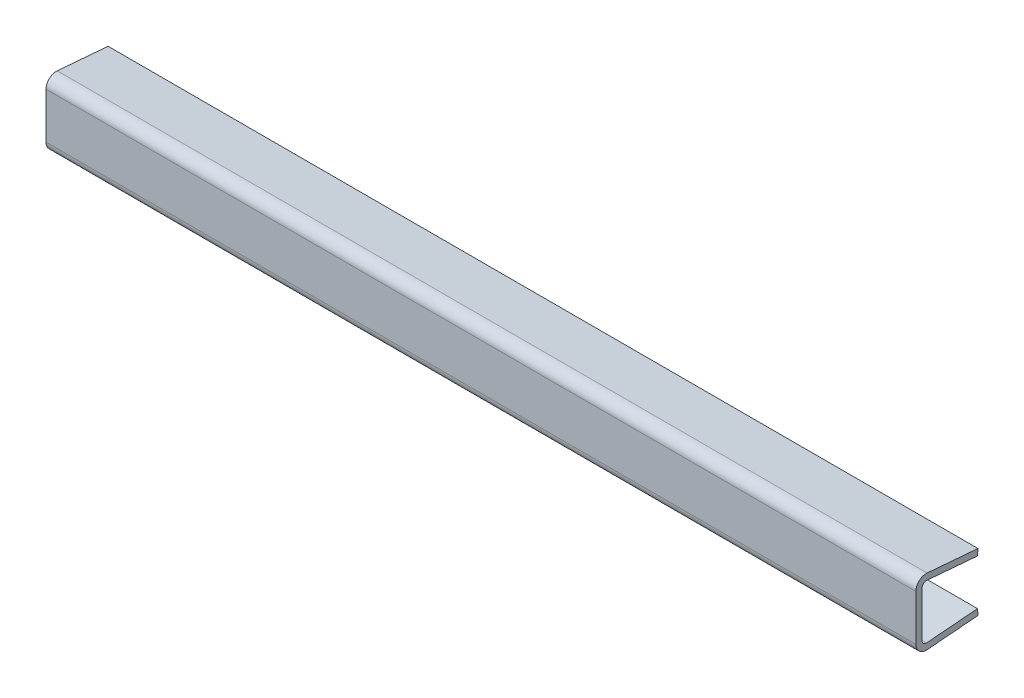
ISO-10303-21;
HEADER;
FILE_DESCRIPTION(('STEP AP214'),'2;1');
FILE_NAME('part.step','',(''),(''),'','','');
FILE_SCHEMA(('AUTOMOTIVE_DESIGN { 1 0 10303 214 1 1 1 1 }'));
ENDSEC;
DATA;
#1=APPLICATION_CONTEXT('core data for automotive mechanical design processes');
#2=APPLICATION_PROTOCOL_DEFINITION('international standard','automotive_design',2000,#1);
#3=PRODUCT_CONTEXT('',#1,'mechanical');
#4=PRODUCT('Part','Part','',(#3));
#5=PRODUCT_RELATED_PRODUCT_CATEGORY('part','',(#4));
#6=PRODUCT_DEFINITION_FORMATION('','',#4);
#7=PRODUCT_DEFINITION_CONTEXT('part definition',#1,'design');
#8=PRODUCT_DEFINITION('design','',#6,#7);
#9=PRODUCT_DEFINITION_SHAPE('','',#8);
#10=(LENGTH_UNIT() NAMED_UNIT(*) SI_UNIT(.MILLI.,.METRE.));
#11=(NAMED_UNIT(*) PLANE_ANGLE_UNIT() SI_UNIT($,.RADIAN.));
#12=(NAMED_UNIT(*) SI_UNIT($,.STERADIAN.) SOLID_ANGLE_UNIT());
#13=UNCERTAINTY_MEASURE_WITH_UNIT(LENGTH_MEASURE(1.E-05),#10,'distance_accuracy_value','');
#14=(GEOMETRIC_REPRESENTATION_CONTEXT(3) GLOBAL_UNCERTAINTY_ASSIGNED_CONTEXT((#13)) GLOBAL_UNIT_ASSIGNED_CONTEXT((#10,
#11,#12)) REPRESENTATION_CONTEXT('',''));
#15=CARTESIAN_POINT('',(0.,0.,0.));
#16=DIRECTION('',(0.,0.,1.));
#17=DIRECTION('',(1.,0.,0.));
#18=AXIS2_PLACEMENT_3D('',#15,#16,#17);
#19=CARTESIAN_POINT('',(21.,6.15660022588363,21.));
#20=DIRECTION('',(-1.,0.,0.));
#21=DIRECTION('',(0.,1.,0.));
#22=AXIS2_PLACEMENT_3D('',#19,#20,#21);
#23=PLANE('',#22);
#24=DIRECTION('',(0.,-0.0830454798537403,-0.99654575824488));
#25=VECTOR('',#24,1.);
#26=CARTESIAN_POINT('',(21.,6.65487310500607,20.9584772600731));
#27=LINE('',#26,#25);
#28=CARTESIAN_POINT('',(21.,6.65487310500607,20.9584772600731));
#29=VERTEX_POINT('',#28);
#30=CARTESIAN_POINT('',(21.,6.45,18.5));
#31=VERTEX_POINT('',#30);
#32=EDGE_CURVE('E248',#29,#31,#27,.T.);
#33=ORIENTED_EDGE('',*,*,#32,.F.);
#34=CARTESIAN_POINT('',(21.,6.15660022588363,21.));
#35=DIRECTION('',(-1.,0.,0.));
#36=DIRECTION('',(0.,0.,1.));
#37=AXIS2_PLACEMENT_3D('',#34,#35,#36);
#38=CIRCLE('',#37,0.5);
#39=CARTESIAN_POINT('',(21.,6.15660022588363,21.5));
#40=VERTEX_POINT('',#39);
#41=EDGE_CURVE('E27',#40,#29,#38,.T.);
#42=ORIENTED_EDGE('',*,*,#41,.F.);
#43=DIRECTION('',(0.,1.,0.));
#44=VECTOR('',#43,1.);
#45=CARTESIAN_POINT('',(21.,3.94339977411633,21.5));
#46=LINE('',#45,#44);
#47=CARTESIAN_POINT('',(21.,3.94339977411633,21.5));
#48=VERTEX_POINT('',#47);
#49=EDGE_CURVE('E164',#48,#40,#46,.T.);
#50=ORIENTED_EDGE('',*,*,#49,.F.);
#51=CARTESIAN_POINT('',(21.,3.94339977411633,21.));
#52=DIRECTION('',(-1.,0.,0.));
#53=DIRECTION('',(0.,0.,-1.));
#54=AXIS2_PLACEMENT_3D('',#51,#52,#53);
#55=CIRCLE('',#54,0.5);
#56=CARTESIAN_POINT('',(21.,3.44512689499389,20.9584772600731));
#57=VERTEX_POINT('',#56);
#58=EDGE_CURVE('E158',#57,#48,#55,.T.);
#59=ORIENTED_EDGE('',*,*,#58,.F.);
#60=DIRECTION('',(0.,-0.08304547985374,0.99654575824488));
#61=VECTOR('',#60,1.);
#62=CARTESIAN_POINT('',(21.,3.65,18.5));
#63=LINE('',#62,#61);
#64=CARTESIAN_POINT('',(21.,3.65,18.5));
#65=VERTEX_POINT('',#64);
#66=EDGE_CURVE('E161',#65,#57,#63,.T.);
#67=ORIENTED_EDGE('',*,*,#66,.F.);
#68=DIRECTION('',(0.,0.99654575824488,0.0830454798537401));
#69=VECTOR('',#68,1.);
#70=CARTESIAN_POINT('',(21.,3.65,18.5));
#71=LINE('',#70,#69);
#72=CARTESIAN_POINT('',(21.,3.94896372747345,18.5249136439561));
#73=VERTEX_POINT('',#72);
#74=EDGE_CURVE('E116',#65,#73,#71,.T.);
#75=ORIENTED_EDGE('',*,*,#74,.T.);
#76=DIRECTION('',(0.,-0.08304547985374,0.99654575824488));
#77=VECTOR('',#76,1.);
#78=CARTESIAN_POINT('',(21.,3.94896372747345,18.5249136439561));
#79=LINE('',#78,#77);
#80=CARTESIAN_POINT('',(21.,3.74409062246735,20.9833909040292));
#81=VERTEX_POINT('',#80);
#82=EDGE_CURVE('E101',#73,#81,#79,.T.);
#83=ORIENTED_EDGE('',*,*,#82,.T.);
#84=CARTESIAN_POINT('',(21.,3.94339977411633,21.));
#85=DIRECTION('',(-1.,0.,0.));
#86=DIRECTION('',(0.,0.,1.));
#87=AXIS2_PLACEMENT_3D('',#84,#85,#86);
#88=CIRCLE('',#87,0.2);
#89=CARTESIAN_POINT('',(21.,3.94339977411633,21.2));
#90=VERTEX_POINT('',#89);
#91=EDGE_CURVE('E215',#81,#90,#88,.T.);
#92=ORIENTED_EDGE('',*,*,#91,.T.);
#93=DIRECTION('',(0.,1.,0.));
#94=VECTOR('',#93,1.);
#95=CARTESIAN_POINT('',(21.,3.94339977411633,21.2));
#96=LINE('',#95,#94);
#97=CARTESIAN_POINT('',(21.,6.15660022588363,21.2));
#98=VERTEX_POINT('',#97);
#99=EDGE_CURVE('E195',#90,#98,#96,.T.);
#100=ORIENTED_EDGE('',*,*,#99,.T.);
#101=CARTESIAN_POINT('',(21.,6.15660022588363,21.));
#102=DIRECTION('',(-1.,0.,0.));
#103=DIRECTION('',(0.,0.,1.));
#104=AXIS2_PLACEMENT_3D('',#101,#102,#103);
#105=CIRCLE('',#104,0.2);
#106=CARTESIAN_POINT('',(21.,6.35590937753261,20.9833909040292));
#107=VERTEX_POINT('',#106);
#108=EDGE_CURVE('E236',#98,#107,#105,.T.);
#109=ORIENTED_EDGE('',*,*,#108,.T.);
#110=DIRECTION('',(0.,-0.0830454798537403,-0.99654575824488));
#111=VECTOR('',#110,1.);
#112=CARTESIAN_POINT('',(21.,6.35590937753261,20.9833909040292));
#113=LINE('',#112,#111);
#114=CARTESIAN_POINT('',(21.,6.15103627252652,18.5249136439561));
#115=VERTEX_POINT('',#114);
#116=EDGE_CURVE('E213',#107,#115,#113,.T.);
#117=ORIENTED_EDGE('',*,*,#116,.T.);
#118=DIRECTION('',(0.,0.99654575824488,-0.0830454798537372));
#119=VECTOR('',#118,1.);
#120=CARTESIAN_POINT('',(21.,6.15103627252652,18.5249136439561));
#121=LINE('',#120,#119);
#122=EDGE_CURVE('E327',#115,#31,#121,.T.);
#123=ORIENTED_EDGE('',*,*,#122,.T.);
#124=EDGE_LOOP('',(#33,#42,#50,#59,#67,#75,#83,#92,#100,#109,#117,#123));
#125=FACE_BOUND('',#124,.T.);
#126=ADVANCED_FACE('F16',(#125),#23,.F.);
#127=CARTESIAN_POINT('',(-21.,6.15660022588366,21.));
#128=DIRECTION('',(-1.,0.,0.));
#129=DIRECTION('',(0.,1.,0.));
#130=AXIS2_PLACEMENT_3D('',#127,#128,#129);
#131=PLANE('',#130);
#132=DIRECTION('',(0.,-0.0830454798537403,-0.99654575824488));
#133=VECTOR('',#132,1.);
#134=CARTESIAN_POINT('',(-21.,6.6548731050061,20.9584772600731));
#135=LINE('',#134,#133);
#136=CARTESIAN_POINT('',(-21.,6.6548731050061,20.9584772600731));
#137=VERTEX_POINT('',#136);
#138=CARTESIAN_POINT('',(-21.,6.45,18.5));
#139=VERTEX_POINT('',#138);
#140=EDGE_CURVE('E197',#137,#139,#135,.T.);
#141=ORIENTED_EDGE('',*,*,#140,.T.);
#142=DIRECTION('',(0.,0.99654575824488,-0.0830454798537372));
#143=VECTOR('',#142,1.);
#144=CARTESIAN_POINT('',(-21.,6.15103627252654,18.5249136439562));
#145=LINE('',#144,#143);
#146=CARTESIAN_POINT('',(-21.,6.15103627252654,18.5249136439562));
#147=VERTEX_POINT('',#146);
#148=EDGE_CURVE('E190',#147,#139,#145,.T.);
#149=ORIENTED_EDGE('',*,*,#148,.F.);
#150=DIRECTION('',(0.,-0.0830454798537403,-0.99654575824488));
#151=VECTOR('',#150,1.);
#152=CARTESIAN_POINT('',(-21.,6.35590937753264,20.9833909040292));
#153=LINE('',#152,#151);
#154=CARTESIAN_POINT('',(-21.,6.35590937753264,20.9833909040292));
#155=VERTEX_POINT('',#154);
#156=EDGE_CURVE('E212',#155,#147,#153,.T.);
#157=ORIENTED_EDGE('',*,*,#156,.F.);
#158=CARTESIAN_POINT('',(-21.,6.15660022588366,21.));
#159=DIRECTION('',(-1.,0.,0.));
#160=DIRECTION('',(0.,0.,1.));
#161=AXIS2_PLACEMENT_3D('',#158,#159,#160);
#162=CIRCLE('',#161,0.2);
#163=CARTESIAN_POINT('',(-21.,6.15660022588366,21.2));
#164=VERTEX_POINT('',#163);
#165=EDGE_CURVE('E228',#164,#155,#162,.T.);
#166=ORIENTED_EDGE('',*,*,#165,.F.);
#167=DIRECTION('',(0.,1.,0.));
#168=VECTOR('',#167,1.);
#169=CARTESIAN_POINT('',(-21.,3.94339977411635,21.2));
#170=LINE('',#169,#168);
#171=CARTESIAN_POINT('',(-21.,3.94339977411635,21.2));
#172=VERTEX_POINT('',#171);
#173=EDGE_CURVE('E194',#172,#164,#170,.T.);
#174=ORIENTED_EDGE('',*,*,#173,.F.);
#175=CARTESIAN_POINT('',(-21.,3.94339977411635,21.));
#176=DIRECTION('',(-1.,0.,0.));
#177=DIRECTION('',(0.,0.,1.));
#178=AXIS2_PLACEMENT_3D('',#175,#176,#177);
#179=CIRCLE('',#178,0.2);
#180=CARTESIAN_POINT('',(-21.,3.74409062246737,20.9833909040292));
#181=VERTEX_POINT('',#180);
#182=EDGE_CURVE('E20',#181,#172,#179,.T.);
#183=ORIENTED_EDGE('',*,*,#182,.F.);
#184=DIRECTION('',(0.,-0.08304547985374,0.99654575824488));
#185=VECTOR('',#184,1.);
#186=CARTESIAN_POINT('',(-21.,3.94896372747347,18.5249136439562));
#187=LINE('',#186,#185);
#188=CARTESIAN_POINT('',(-21.,3.94896372747347,18.5249136439562));
#189=VERTEX_POINT('',#188);
#190=EDGE_CURVE('E110',#189,#181,#187,.T.);
#191=ORIENTED_EDGE('',*,*,#190,.F.);
#192=DIRECTION('',(0.,0.99654575824488,0.0830454798537401));
#193=VECTOR('',#192,1.);
#194=CARTESIAN_POINT('',(-21.,3.65,18.5));
#195=LINE('',#194,#193);
#196=CARTESIAN_POINT('',(-21.,3.65,18.5));
#197=VERTEX_POINT('',#196);
#198=EDGE_CURVE('E180',#197,#189,#195,.T.);
#199=ORIENTED_EDGE('',*,*,#198,.F.);
#200=DIRECTION('',(0.,-0.08304547985374,0.99654575824488));
#201=VECTOR('',#200,1.);
#202=CARTESIAN_POINT('',(-21.,3.65,18.5));
#203=LINE('',#202,#201);
#204=CARTESIAN_POINT('',(-21.,3.44512689499391,20.9584772600731));
#205=VERTEX_POINT('',#204);
#206=EDGE_CURVE('E168',#197,#205,#203,.T.);
#207=ORIENTED_EDGE('',*,*,#206,.T.);
#208=CARTESIAN_POINT('',(-21.,3.94339977411635,21.));
#209=DIRECTION('',(-1.,0.,0.));
#210=DIRECTION('',(0.,0.,-1.));
#211=AXIS2_PLACEMENT_3D('',#208,#209,#210);
#212=CIRCLE('',#211,0.5);
#213=CARTESIAN_POINT('',(-21.,3.94339977411635,21.5));
#214=VERTEX_POINT('',#213);
#215=EDGE_CURVE('E151',#205,#214,#212,.T.);
#216=ORIENTED_EDGE('',*,*,#215,.T.);
#217=DIRECTION('',(0.,1.,0.));
#218=VECTOR('',#217,1.);
#219=CARTESIAN_POINT('',(-21.,3.94339977411635,21.5));
#220=LINE('',#219,#218);
#221=CARTESIAN_POINT('',(-21.,6.15660022588366,21.5));
#222=VERTEX_POINT('',#221);
#223=EDGE_CURVE('E230',#214,#222,#220,.T.);
#224=ORIENTED_EDGE('',*,*,#223,.T.);
#225=CARTESIAN_POINT('',(-21.,6.15660022588366,21.));
#226=DIRECTION('',(-1.,0.,0.));
#227=DIRECTION('',(0.,0.,1.));
#228=AXIS2_PLACEMENT_3D('',#225,#226,#227);
#229=CIRCLE('',#228,0.5);
#230=EDGE_CURVE('E11',#222,#137,#229,.T.);
#231=ORIENTED_EDGE('',*,*,#230,.T.);
#232=EDGE_LOOP('',(#141,#149,#157,#166,#174,#183,#191,#199,#207,#216,#224,#231));
#233=FACE_BOUND('',#232,.T.);
#234=ADVANCED_FACE('F260',(#233),#131,.T.);
#235=CARTESIAN_POINT('',(-21.,6.15660022588366,21.));
#236=DIRECTION('',(1.,0.,0.));
#237=DIRECTION('',(0.,0.,-1.));
#238=AXIS2_PLACEMENT_3D('',#235,#236,#237);
#239=CYLINDRICAL_SURFACE('',#238,0.5);
#240=ORIENTED_EDGE('',*,*,#41,.T.);
#241=DIRECTION('',(1.,0.,0.));
#242=VECTOR('',#241,1.);
#243=CARTESIAN_POINT('',(-21.,6.6548731050061,20.9584772600731));
#244=LINE('',#243,#242);
#245=EDGE_CURVE('E201',#137,#29,#244,.T.);
#246=ORIENTED_EDGE('',*,*,#245,.F.);
#247=ORIENTED_EDGE('',*,*,#230,.F.);
#248=DIRECTION('',(1.,0.,0.));
#249=VECTOR('',#248,1.);
#250=CARTESIAN_POINT('',(-21.,6.15660022588366,21.5));
#251=LINE('',#250,#249);
#252=EDGE_CURVE('E233',#222,#40,#251,.T.);
#253=ORIENTED_EDGE('',*,*,#252,.T.);
#254=EDGE_LOOP('',(#240,#246,#247,#253));
#255=FACE_BOUND('',#254,.T.);
#256=ADVANCED_FACE('F276',(#255),#239,.T.);
#257=CARTESIAN_POINT('',(-21.,3.94339977411635,21.5));
#258=DIRECTION('',(0.,0.,-1.));
#259=DIRECTION('',(0.,-1.,0.));
#260=AXIS2_PLACEMENT_3D('',#257,#258,#259);
#261=PLANE('',#260);
#262=ORIENTED_EDGE('',*,*,#49,.T.);
#263=ORIENTED_EDGE('',*,*,#252,.F.);
#264=ORIENTED_EDGE('',*,*,#223,.F.);
#265=DIRECTION('',(1.,0.,0.));
#266=VECTOR('',#265,1.);
#267=CARTESIAN_POINT('',(-21.,3.94339977411635,21.5));
#268=LINE('',#267,#266);
#269=EDGE_CURVE('E167',#214,#48,#268,.T.);
#270=ORIENTED_EDGE('',*,*,#269,.T.);
#271=EDGE_LOOP('',(#262,#263,#264,#270));
#272=FACE_BOUND('',#271,.T.);
#273=ADVANCED_FACE('F282',(#272),#261,.F.);
#274=CARTESIAN_POINT('',(-21.,3.94339977411635,21.));
#275=DIRECTION('',(1.,0.,0.));
#276=DIRECTION('',(0.,0.,-1.));
#277=AXIS2_PLACEMENT_3D('',#274,#275,#276);
#278=CYLINDRICAL_SURFACE('',#277,0.5);
#279=ORIENTED_EDGE('',*,*,#58,.T.);
#280=ORIENTED_EDGE('',*,*,#269,.F.);
#281=ORIENTED_EDGE('',*,*,#215,.F.);
#282=DIRECTION('',(1.,0.,0.));
#283=VECTOR('',#282,1.);
#284=CARTESIAN_POINT('',(-21.,3.44512689499391,20.9584772600731));
#285=LINE('',#284,#283);
#286=EDGE_CURVE('E171',#205,#57,#285,.T.);
#287=ORIENTED_EDGE('',*,*,#286,.T.);
#288=EDGE_LOOP('',(#279,#280,#281,#287));
#289=FACE_BOUND('',#288,.T.);
#290=ADVANCED_FACE('F172',(#289),#278,.T.);
#291=CARTESIAN_POINT('',(-21.,3.65,18.5));
#292=DIRECTION('',(0.,0.99654575824488,0.08304547985374));
#293=DIRECTION('',(1.,0.,0.));
#294=AXIS2_PLACEMENT_3D('',#291,#292,#293);
#295=PLANE('',#294);
#296=ORIENTED_EDGE('',*,*,#66,.T.);
#297=ORIENTED_EDGE('',*,*,#286,.F.);
#298=ORIENTED_EDGE('',*,*,#206,.F.);
#299=DIRECTION('',(1.,0.,0.));
#300=VECTOR('',#299,1.);
#301=CARTESIAN_POINT('',(-21.,3.65,18.5));
#302=LINE('',#301,#300);
#303=EDGE_CURVE('E178',#197,#65,#302,.T.);
#304=ORIENTED_EDGE('',*,*,#303,.T.);
#305=EDGE_LOOP('',(#296,#297,#298,#304));
#306=FACE_BOUND('',#305,.T.);
#307=ADVANCED_FACE('F176',(#306),#295,.F.);
#308=CARTESIAN_POINT('',(-21.,3.65,18.5));
#309=DIRECTION('',(0.,0.0830454798537401,-0.99654575824488));
#310=DIRECTION('',(-1.,0.,0.));
#311=AXIS2_PLACEMENT_3D('',#308,#309,#310);
#312=PLANE('',#311);
#313=ORIENTED_EDGE('',*,*,#74,.F.);
#314=ORIENTED_EDGE('',*,*,#303,.F.);
#315=ORIENTED_EDGE('',*,*,#198,.T.);
#316=DIRECTION('',(1.,0.,0.));
#317=VECTOR('',#316,1.);
#318=CARTESIAN_POINT('',(-21.,3.94896372747347,18.5249136439562));
#319=LINE('',#318,#317);
#320=EDGE_CURVE('E207',#189,#73,#319,.T.);
#321=ORIENTED_EDGE('',*,*,#320,.T.);
#322=EDGE_LOOP('',(#313,#314,#315,#321));
#323=FACE_BOUND('',#322,.T.);
#324=ADVANCED_FACE('F18',(#323),#312,.T.);
#325=CARTESIAN_POINT('',(-21.,3.94896372747347,18.5249136439562));
#326=DIRECTION('',(0.,0.99654575824488,0.08304547985374));
#327=DIRECTION('',(1.,0.,0.));
#328=AXIS2_PLACEMENT_3D('',#325,#326,#327);
#329=PLANE('',#328);
#330=ORIENTED_EDGE('',*,*,#82,.F.);
#331=ORIENTED_EDGE('',*,*,#320,.F.);
#332=ORIENTED_EDGE('',*,*,#190,.T.);
#333=DIRECTION('',(1.,0.,0.));
#334=VECTOR('',#333,1.);
#335=CARTESIAN_POINT('',(-21.,3.74409062246737,20.9833909040292));
#336=LINE('',#335,#334);
#337=EDGE_CURVE('E237',#181,#81,#336,.T.);
#338=ORIENTED_EDGE('',*,*,#337,.T.);
#339=EDGE_LOOP('',(#330,#331,#332,#338));
#340=FACE_BOUND('',#339,.T.);
#341=ADVANCED_FACE('F262',(#340),#329,.T.);
#342=CARTESIAN_POINT('',(-21.,3.94339977411635,21.));
#343=DIRECTION('',(1.,0.,0.));
#344=DIRECTION('',(0.,0.,-1.));
#345=AXIS2_PLACEMENT_3D('',#342,#343,#344);
#346=CYLINDRICAL_SURFACE('',#345,0.2);
#347=ORIENTED_EDGE('',*,*,#91,.F.);
#348=ORIENTED_EDGE('',*,*,#337,.F.);
#349=ORIENTED_EDGE('',*,*,#182,.T.);
#350=DIRECTION('',(1.,0.,0.));
#351=VECTOR('',#350,1.);
#352=CARTESIAN_POINT('',(-21.,3.94339977411635,21.2));
#353=LINE('',#352,#351);
#354=EDGE_CURVE('E192',#172,#90,#353,.T.);
#355=ORIENTED_EDGE('',*,*,#354,.T.);
#356=EDGE_LOOP('',(#347,#348,#349,#355));
#357=FACE_BOUND('',#356,.T.);
#358=ADVANCED_FACE('F268',(#357),#346,.F.);
#359=CARTESIAN_POINT('',(-21.,3.94339977411635,21.2));
#360=DIRECTION('',(0.,0.,-1.));
#361=DIRECTION('',(0.,-1.,0.));
#362=AXIS2_PLACEMENT_3D('',#359,#360,#361);
#363=PLANE('',#362);
#364=ORIENTED_EDGE('',*,*,#99,.F.);
#365=ORIENTED_EDGE('',*,*,#354,.F.);
#366=ORIENTED_EDGE('',*,*,#173,.T.);
#367=DIRECTION('',(1.,0.,0.));
#368=VECTOR('',#367,1.);
#369=CARTESIAN_POINT('',(-21.,6.15660022588366,21.2));
#370=LINE('',#369,#368);
#371=EDGE_CURVE('E242',#164,#98,#370,.T.);
#372=ORIENTED_EDGE('',*,*,#371,.T.);
#373=EDGE_LOOP('',(#364,#365,#366,#372));
#374=FACE_BOUND('',#373,.T.);
#375=ADVANCED_FACE('F286',(#374),#363,.T.);
#376=CARTESIAN_POINT('',(-21.,6.15660022588366,21.));
#377=DIRECTION('',(1.,0.,0.));
#378=DIRECTION('',(0.,0.,-1.));
#379=AXIS2_PLACEMENT_3D('',#376,#377,#378);
#380=CYLINDRICAL_SURFACE('',#379,0.2);
#381=ORIENTED_EDGE('',*,*,#108,.F.);
#382=ORIENTED_EDGE('',*,*,#371,.F.);
#383=ORIENTED_EDGE('',*,*,#165,.T.);
#384=DIRECTION('',(1.,0.,0.));
#385=VECTOR('',#384,1.);
#386=CARTESIAN_POINT('',(-21.,6.35590937753264,20.9833909040292));
#387=LINE('',#386,#385);
#388=EDGE_CURVE('E208',#155,#107,#387,.T.);
#389=ORIENTED_EDGE('',*,*,#388,.T.);
#390=EDGE_LOOP('',(#381,#382,#383,#389));
#391=FACE_BOUND('',#390,.T.);
#392=ADVANCED_FACE('F289',(#391),#380,.F.);
#393=CARTESIAN_POINT('',(-21.,6.35590937753264,20.9833909040292));
#394=DIRECTION('',(0.,-0.99654575824488,0.0830454798537403));
#395=DIRECTION('',(0.,0.0830454798537403,0.99654575824488));
#396=AXIS2_PLACEMENT_3D('',#393,#394,#395);
#397=PLANE('',#396);
#398=ORIENTED_EDGE('',*,*,#116,.F.);
#399=ORIENTED_EDGE('',*,*,#388,.F.);
#400=ORIENTED_EDGE('',*,*,#156,.T.);
#401=DIRECTION('',(1.,0.,0.));
#402=VECTOR('',#401,1.);
#403=CARTESIAN_POINT('',(-21.,6.15103627252654,18.5249136439562));
#404=LINE('',#403,#402);
#405=EDGE_CURVE('E318',#147,#115,#404,.T.);
#406=ORIENTED_EDGE('',*,*,#405,.T.);
#407=EDGE_LOOP('',(#398,#399,#400,#406));
#408=FACE_BOUND('',#407,.T.);
#409=ADVANCED_FACE('F280',(#408),#397,.T.);
#410=CARTESIAN_POINT('',(-21.,6.15103627252654,18.5249136439562));
#411=DIRECTION('',(0.,-0.0830454798537372,-0.99654575824488));
#412=DIRECTION('',(1.,0.,0.));
#413=AXIS2_PLACEMENT_3D('',#410,#411,#412);
#414=PLANE('',#413);
#415=ORIENTED_EDGE('',*,*,#122,.F.);
#416=ORIENTED_EDGE('',*,*,#405,.F.);
#417=ORIENTED_EDGE('',*,*,#148,.T.);
#418=DIRECTION('',(1.,0.,0.));
#419=VECTOR('',#418,1.);
#420=CARTESIAN_POINT('',(-21.,6.45,18.5));
#421=LINE('',#420,#419);
#422=EDGE_CURVE('E202',#139,#31,#421,.T.);
#423=ORIENTED_EDGE('',*,*,#422,.T.);
#424=EDGE_LOOP('',(#415,#416,#417,#423));
#425=FACE_BOUND('',#424,.T.);
#426=ADVANCED_FACE('F297',(#425),#414,.T.);
#427=CARTESIAN_POINT('',(-21.,6.6548731050061,20.9584772600731));
#428=DIRECTION('',(0.,-0.99654575824488,0.0830454798537403));
#429=DIRECTION('',(0.,0.0830454798537403,0.99654575824488));
#430=AXIS2_PLACEMENT_3D('',#427,#428,#429);
#431=PLANE('',#430);
#432=ORIENTED_EDGE('',*,*,#32,.T.);
#433=ORIENTED_EDGE('',*,*,#422,.F.);
#434=ORIENTED_EDGE('',*,*,#140,.F.);
#435=ORIENTED_EDGE('',*,*,#245,.T.);
#436=EDGE_LOOP('',(#432,#433,#434,#435));
#437=FACE_BOUND('',#436,.T.);
#438=ADVANCED_FACE('F295',(#437),#431,.F.);
#439=CLOSED_SHELL('',(#126,#234,#256,#273,#290,#307,#324,#341,#358,#375,#392,#409,#426,#438));
#440=MANIFOLD_SOLID_BREP('B1',#439);
#441=ADVANCED_BREP_SHAPE_REPRESENTATION('',(#18,#440),#14);
#442=SHAPE_DEFINITION_REPRESENTATION(#9,#441);
ENDSEC;
END-ISO-10303-21;
